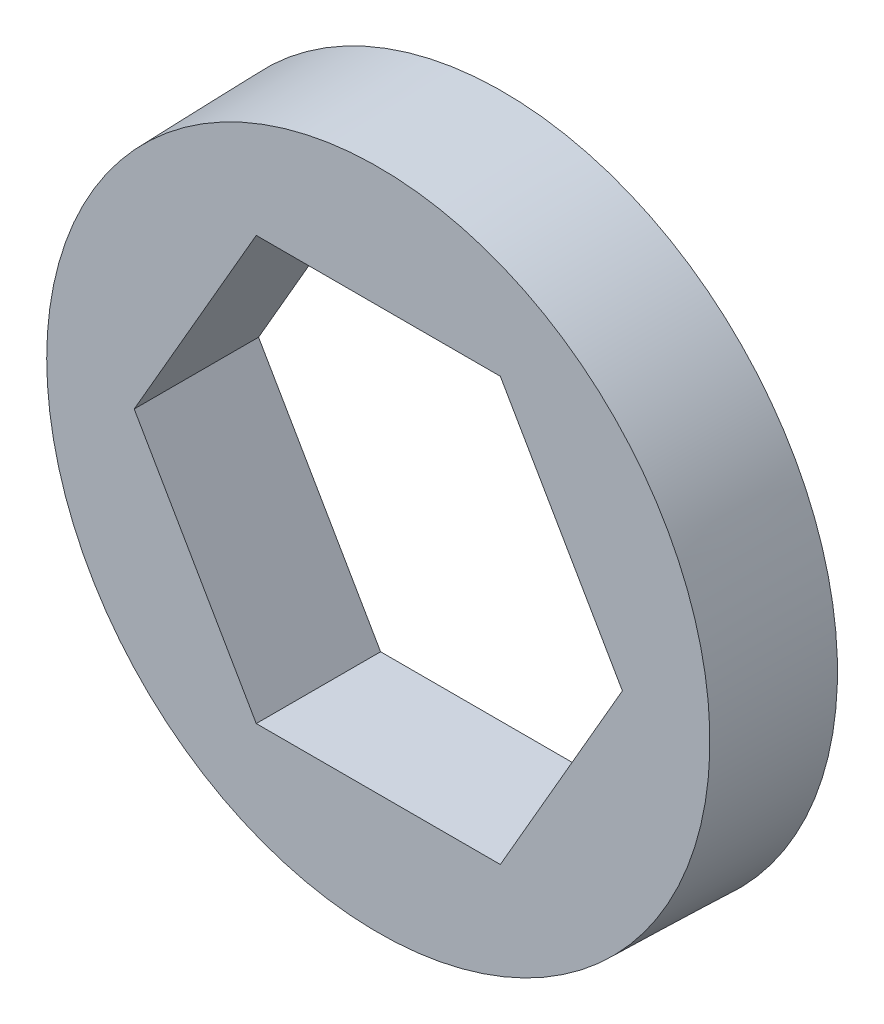
ISO-10303-21;
HEADER;
FILE_DESCRIPTION(('STEP AP214'),'2;1');
FILE_NAME('part.step','',(''),(''),'','','');
FILE_SCHEMA(('AUTOMOTIVE_DESIGN { 1 0 10303 214 1 1 1 1 }'));
ENDSEC;
DATA;
#1=APPLICATION_CONTEXT('core data for automotive mechanical design processes');
#2=APPLICATION_PROTOCOL_DEFINITION('international standard','automotive_design',2000,#1);
#3=PRODUCT_CONTEXT('',#1,'mechanical');
#4=PRODUCT('Part','Part','',(#3));
#5=PRODUCT_RELATED_PRODUCT_CATEGORY('part','',(#4));
#6=PRODUCT_DEFINITION_FORMATION('','',#4);
#7=PRODUCT_DEFINITION_CONTEXT('part definition',#1,'design');
#8=PRODUCT_DEFINITION('design','',#6,#7);
#9=PRODUCT_DEFINITION_SHAPE('','',#8);
#10=(LENGTH_UNIT() NAMED_UNIT(*) SI_UNIT(.MILLI.,.METRE.));
#11=(NAMED_UNIT(*) PLANE_ANGLE_UNIT() SI_UNIT($,.RADIAN.));
#12=(NAMED_UNIT(*) SI_UNIT($,.STERADIAN.) SOLID_ANGLE_UNIT());
#13=UNCERTAINTY_MEASURE_WITH_UNIT(LENGTH_MEASURE(1.E-05),#10,'distance_accuracy_value','');
#14=(GEOMETRIC_REPRESENTATION_CONTEXT(3) GLOBAL_UNCERTAINTY_ASSIGNED_CONTEXT((#13)) GLOBAL_UNIT_ASSIGNED_CONTEXT((#10,
#11,#12)) REPRESENTATION_CONTEXT('',''));
#15=CARTESIAN_POINT('',(0.,0.,0.));
#16=DIRECTION('',(0.,0.,1.));
#17=DIRECTION('',(1.,0.,0.));
#18=AXIS2_PLACEMENT_3D('',#15,#16,#17);
#19=CARTESIAN_POINT('',(0.,0.,0.75));
#20=DIRECTION('',(0.,0.,1.));
#21=DIRECTION('',(1.,0.,0.));
#22=AXIS2_PLACEMENT_3D('',#19,#20,#21);
#23=PLANE('',#22);
#24=CARTESIAN_POINT('',(0.,0.,0.749999999982265));
#25=DIRECTION('',(0.,0.,-1.));
#26=DIRECTION('',(-1.,0.,0.));
#27=AXIS2_PLACEMENT_3D('',#24,#25,#26);
#28=CIRCLE('',#27,3.99999999999778);
#29=CARTESIAN_POINT('',(-3.99999999999778,0.,0.749999999982265));
#30=VERTEX_POINT('',#29);
#31=EDGE_CURVE('E18',#30,#30,#28,.T.);
#32=ORIENTED_EDGE('',*,*,#31,.F.);
#33=EDGE_LOOP('',(#32));
#34=FACE_BOUND('',#33,.T.);
#35=DIRECTION('',(-0.5,-0.866025403784439,0.));
#36=VECTOR('',#35,1.);
#37=CARTESIAN_POINT('',(-1.47224318643355,2.55,0.75));
#38=LINE('',#37,#36);
#39=CARTESIAN_POINT('',(-2.94448637286709,0.,0.750000000000001));
#40=VERTEX_POINT('',#39);
#41=CARTESIAN_POINT('',(-1.47224318643355,2.55,0.75));
#42=VERTEX_POINT('',#41);
#43=EDGE_CURVE('E89',#40,#42,#38,.F.);
#44=ORIENTED_EDGE('',*,*,#43,.T.);
#45=DIRECTION('',(1.,0.,0.));
#46=VECTOR('',#45,1.);
#47=CARTESIAN_POINT('',(1.47224318643355,2.55,0.75));
#48=LINE('',#47,#46);
#49=CARTESIAN_POINT('',(1.47224318643355,2.55,0.75));
#50=VERTEX_POINT('',#49);
#51=EDGE_CURVE('E94',#42,#50,#48,.T.);
#52=ORIENTED_EDGE('',*,*,#51,.T.);
#53=DIRECTION('',(-0.5,0.866025403784439,0.));
#54=VECTOR('',#53,1.);
#55=CARTESIAN_POINT('',(2.94448637286709,0.,0.75));
#56=LINE('',#55,#54);
#57=CARTESIAN_POINT('',(2.94448637286709,0.,0.75));
#58=VERTEX_POINT('',#57);
#59=EDGE_CURVE('E99',#50,#58,#56,.F.);
#60=ORIENTED_EDGE('',*,*,#59,.T.);
#61=DIRECTION('',(0.5,0.866025403784439,0.));
#62=VECTOR('',#61,1.);
#63=CARTESIAN_POINT('',(1.47224318643355,-2.55,0.75));
#64=LINE('',#63,#62);
#65=CARTESIAN_POINT('',(1.47224318643355,-2.55,0.75));
#66=VERTEX_POINT('',#65);
#67=EDGE_CURVE('E69',#58,#66,#64,.F.);
#68=ORIENTED_EDGE('',*,*,#67,.T.);
#69=DIRECTION('',(1.,0.,0.));
#70=VECTOR('',#69,1.);
#71=CARTESIAN_POINT('',(-1.47224318643354,-2.55,0.75));
#72=LINE('',#71,#70);
#73=CARTESIAN_POINT('',(-1.47224318643355,-2.55,0.75));
#74=VERTEX_POINT('',#73);
#75=EDGE_CURVE('E68',#66,#74,#72,.F.);
#76=ORIENTED_EDGE('',*,*,#75,.T.);
#77=DIRECTION('',(0.5,-0.866025403784439,0.));
#78=VECTOR('',#77,1.);
#79=CARTESIAN_POINT('',(-2.94448637286709,0.,0.750000000000001));
#80=LINE('',#79,#78);
#81=EDGE_CURVE('E65',#74,#40,#80,.F.);
#82=ORIENTED_EDGE('',*,*,#81,.T.);
#83=EDGE_LOOP('',(#44,#52,#60,#68,#76,#82));
#84=FACE_BOUND('',#83,.T.);
#85=ADVANCED_FACE('F15',(#34,#84),#23,.T.);
#86=CARTESIAN_POINT('',(-1.47224318643354,-2.55,0.));
#87=DIRECTION('',(0.,-1.,0.));
#88=DIRECTION('',(0.,0.,-1.));
#89=AXIS2_PLACEMENT_3D('',#86,#87,#88);
#90=PLANE('',#89);
#91=DIRECTION('',(0.,0.,1.));
#92=VECTOR('',#91,1.);
#93=CARTESIAN_POINT('',(-1.47224318643355,-2.55,0.));
#94=LINE('',#93,#92);
#95=CARTESIAN_POINT('',(-1.47224318643355,-2.55,-0.75));
#96=VERTEX_POINT('',#95);
#97=EDGE_CURVE('E74',#96,#74,#94,.T.);
#98=ORIENTED_EDGE('',*,*,#97,.T.);
#99=ORIENTED_EDGE('',*,*,#75,.F.);
#100=DIRECTION('',(0.,0.,1.));
#101=VECTOR('',#100,1.);
#102=CARTESIAN_POINT('',(1.47224318643355,-2.55,0.));
#103=LINE('',#102,#101);
#104=CARTESIAN_POINT('',(1.47224318643355,-2.55,-0.75));
#105=VERTEX_POINT('',#104);
#106=EDGE_CURVE('E103',#66,#105,#103,.F.);
#107=ORIENTED_EDGE('',*,*,#106,.T.);
#108=DIRECTION('',(1.,0.,0.));
#109=VECTOR('',#108,1.);
#110=CARTESIAN_POINT('',(0.,-2.55,-0.75));
#111=LINE('',#110,#109);
#112=EDGE_CURVE('E85',#105,#96,#111,.F.);
#113=ORIENTED_EDGE('',*,*,#112,.T.);
#114=EDGE_LOOP('',(#98,#99,#107,#113));
#115=FACE_BOUND('',#114,.T.);
#116=ADVANCED_FACE('F84',(#115),#90,.F.);
#117=CARTESIAN_POINT('',(-2.94448637286709,0.,0.));
#118=DIRECTION('',(-0.866025403784439,-0.5,0.));
#119=DIRECTION('',(0.5,-0.866025403784439,0.));
#120=AXIS2_PLACEMENT_3D('',#117,#118,#119);
#121=PLANE('',#120);
#122=DIRECTION('',(0.,0.,1.));
#123=VECTOR('',#122,1.);
#124=CARTESIAN_POINT('',(-2.94448637286709,0.,0.));
#125=LINE('',#124,#123);
#126=CARTESIAN_POINT('',(-2.94448637286709,0.,-0.75));
#127=VERTEX_POINT('',#126);
#128=EDGE_CURVE('E81',#127,#40,#125,.T.);
#129=ORIENTED_EDGE('',*,*,#128,.T.);
#130=ORIENTED_EDGE('',*,*,#81,.F.);
#131=ORIENTED_EDGE('',*,*,#97,.F.);
#132=DIRECTION('',(-0.5,0.866025403784439,0.));
#133=VECTOR('',#132,1.);
#134=CARTESIAN_POINT('',(-1.47224318643355,-2.55,-0.75));
#135=LINE('',#134,#133);
#136=EDGE_CURVE('E106',#96,#127,#135,.T.);
#137=ORIENTED_EDGE('',*,*,#136,.T.);
#138=EDGE_LOOP('',(#129,#130,#131,#137));
#139=FACE_BOUND('',#138,.T.);
#140=ADVANCED_FACE('F78',(#139),#121,.F.);
#141=CARTESIAN_POINT('',(-1.47224318643355,2.55,0.));
#142=DIRECTION('',(-0.866025403784439,0.5,0.));
#143=DIRECTION('',(-0.5,-0.866025403784439,0.));
#144=AXIS2_PLACEMENT_3D('',#141,#142,#143);
#145=PLANE('',#144);
#146=DIRECTION('',(0.,0.,1.));
#147=VECTOR('',#146,1.);
#148=CARTESIAN_POINT('',(-1.47224318643355,2.55,0.));
#149=LINE('',#148,#147);
#150=CARTESIAN_POINT('',(-1.47224318643355,2.55,-0.75));
#151=VERTEX_POINT('',#150);
#152=EDGE_CURVE('E91',#151,#42,#149,.T.);
#153=ORIENTED_EDGE('',*,*,#152,.T.);
#154=ORIENTED_EDGE('',*,*,#43,.F.);
#155=ORIENTED_EDGE('',*,*,#128,.F.);
#156=DIRECTION('',(0.5,0.866025403784439,0.));
#157=VECTOR('',#156,1.);
#158=CARTESIAN_POINT('',(-2.94448637286709,0.,-0.75));
#159=LINE('',#158,#157);
#160=EDGE_CURVE('E108',#127,#151,#159,.T.);
#161=ORIENTED_EDGE('',*,*,#160,.T.);
#162=EDGE_LOOP('',(#153,#154,#155,#161));
#163=FACE_BOUND('',#162,.T.);
#164=ADVANCED_FACE('F130',(#163),#145,.F.);
#165=CARTESIAN_POINT('',(1.47224318643355,2.55,0.));
#166=DIRECTION('',(0.,1.,0.));
#167=DIRECTION('',(0.,0.,1.));
#168=AXIS2_PLACEMENT_3D('',#165,#166,#167);
#169=PLANE('',#168);
#170=DIRECTION('',(0.,0.,1.));
#171=VECTOR('',#170,1.);
#172=CARTESIAN_POINT('',(1.47224318643355,2.55,0.));
#173=LINE('',#172,#171);
#174=CARTESIAN_POINT('',(1.47224318643355,2.55,-0.75));
#175=VERTEX_POINT('',#174);
#176=EDGE_CURVE('E96',#175,#50,#173,.T.);
#177=ORIENTED_EDGE('',*,*,#176,.T.);
#178=ORIENTED_EDGE('',*,*,#51,.F.);
#179=ORIENTED_EDGE('',*,*,#152,.F.);
#180=DIRECTION('',(1.,0.,0.));
#181=VECTOR('',#180,1.);
#182=CARTESIAN_POINT('',(0.,2.55,-0.75));
#183=LINE('',#182,#181);
#184=EDGE_CURVE('E111',#151,#175,#183,.T.);
#185=ORIENTED_EDGE('',*,*,#184,.T.);
#186=EDGE_LOOP('',(#177,#178,#179,#185));
#187=FACE_BOUND('',#186,.T.);
#188=ADVANCED_FACE('F127',(#187),#169,.F.);
#189=CARTESIAN_POINT('',(2.94448637286709,0.,0.));
#190=DIRECTION('',(0.866025403784439,0.5,0.));
#191=DIRECTION('',(-0.5,0.866025403784439,0.));
#192=AXIS2_PLACEMENT_3D('',#189,#190,#191);
#193=PLANE('',#192);
#194=DIRECTION('',(0.,0.,1.));
#195=VECTOR('',#194,1.);
#196=CARTESIAN_POINT('',(2.94448637286709,0.,0.));
#197=LINE('',#196,#195);
#198=CARTESIAN_POINT('',(2.94448637286709,0.,-0.75));
#199=VERTEX_POINT('',#198);
#200=EDGE_CURVE('E32',#199,#58,#197,.T.);
#201=ORIENTED_EDGE('',*,*,#200,.T.);
#202=ORIENTED_EDGE('',*,*,#59,.F.);
#203=ORIENTED_EDGE('',*,*,#176,.F.);
#204=DIRECTION('',(0.5,-0.866025403784439,0.));
#205=VECTOR('',#204,1.);
#206=CARTESIAN_POINT('',(1.47224318643355,2.55,-0.75));
#207=LINE('',#206,#205);
#208=EDGE_CURVE('E114',#175,#199,#207,.T.);
#209=ORIENTED_EDGE('',*,*,#208,.T.);
#210=EDGE_LOOP('',(#201,#202,#203,#209));
#211=FACE_BOUND('',#210,.T.);
#212=ADVANCED_FACE('F123',(#211),#193,.F.);
#213=CARTESIAN_POINT('',(1.47224318643355,-2.55,0.));
#214=DIRECTION('',(0.866025403784439,-0.5,0.));
#215=DIRECTION('',(0.5,0.866025403784439,0.));
#216=AXIS2_PLACEMENT_3D('',#213,#214,#215);
#217=PLANE('',#216);
#218=ORIENTED_EDGE('',*,*,#106,.F.);
#219=ORIENTED_EDGE('',*,*,#67,.F.);
#220=ORIENTED_EDGE('',*,*,#200,.F.);
#221=DIRECTION('',(-0.5,-0.866025403784439,0.));
#222=VECTOR('',#221,1.);
#223=CARTESIAN_POINT('',(2.94448637286709,0.,-0.75));
#224=LINE('',#223,#222);
#225=EDGE_CURVE('E24',#199,#105,#224,.T.);
#226=ORIENTED_EDGE('',*,*,#225,.T.);
#227=EDGE_LOOP('',(#218,#219,#220,#226));
#228=FACE_BOUND('',#227,.T.);
#229=ADVANCED_FACE('F117',(#228),#217,.F.);
#230=CARTESIAN_POINT('',(0.,0.,-0.749999999982265));
#231=DIRECTION('',(0.,0.,-1.));
#232=DIRECTION('',(-1.,0.,0.));
#233=AXIS2_PLACEMENT_3D('',#230,#231,#232);
#234=CONICAL_SURFACE('',#233,4.03927888230626,0.0261799387503542);
#235=ORIENTED_EDGE('',*,*,#31,.T.);
#236=EDGE_LOOP('',(#235));
#237=FACE_BOUND('',#236,.T.);
#238=CARTESIAN_POINT('',(0.,0.,-0.749999999982265));
#239=DIRECTION('',(0.,0.,-1.));
#240=DIRECTION('',(-1.,0.,0.));
#241=AXIS2_PLACEMENT_3D('',#238,#239,#240);
#242=CIRCLE('',#241,4.03927888230626);
#243=CARTESIAN_POINT('',(-4.03927888230626,0.,-0.749999999982265));
#244=VERTEX_POINT('',#243);
#245=EDGE_CURVE('E10',#244,#244,#242,.F.);
#246=ORIENTED_EDGE('',*,*,#245,.T.);
#247=EDGE_LOOP('',(#246));
#248=FACE_BOUND('',#247,.T.);
#249=ADVANCED_FACE('F141',(#237,#248),#234,.T.);
#250=CARTESIAN_POINT('',(0.,0.,-0.75));
#251=DIRECTION('',(0.,0.,1.));
#252=DIRECTION('',(1.,0.,0.));
#253=AXIS2_PLACEMENT_3D('',#250,#251,#252);
#254=PLANE('',#253);
#255=ORIENTED_EDGE('',*,*,#245,.F.);
#256=EDGE_LOOP('',(#255));
#257=FACE_BOUND('',#256,.T.);
#258=ORIENTED_EDGE('',*,*,#208,.F.);
#259=ORIENTED_EDGE('',*,*,#184,.F.);
#260=ORIENTED_EDGE('',*,*,#160,.F.);
#261=ORIENTED_EDGE('',*,*,#136,.F.);
#262=ORIENTED_EDGE('',*,*,#112,.F.);
#263=ORIENTED_EDGE('',*,*,#225,.F.);
#264=EDGE_LOOP('',(#258,#259,#260,#261,#262,#263));
#265=FACE_BOUND('',#264,.T.);
#266=ADVANCED_FACE('F120',(#257,#265),#254,.F.);
#267=CLOSED_SHELL('',(#85,#116,#140,#164,#188,#212,#229,#249,#266));
#268=MANIFOLD_SOLID_BREP('B1',#267);
#269=ADVANCED_BREP_SHAPE_REPRESENTATION('',(#18,#268),#14);
#270=SHAPE_DEFINITION_REPRESENTATION(#9,#269);
ENDSEC;
END-ISO-10303-21;
